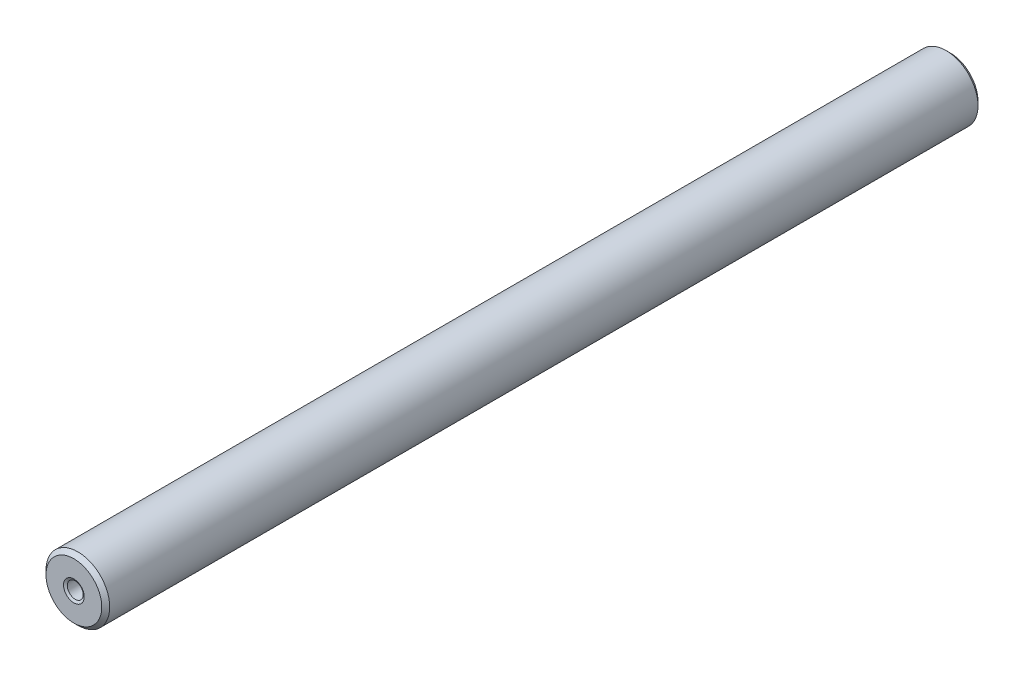
ISO-10303-21;
HEADER;
FILE_DESCRIPTION(('STEP AP214'),'2;1');
FILE_NAME('part.step','',(''),(''),'','','');
FILE_SCHEMA(('AUTOMOTIVE_DESIGN { 1 0 10303 214 1 1 1 1 }'));
ENDSEC;
DATA;
#1=APPLICATION_CONTEXT('core data for automotive mechanical design processes');
#2=APPLICATION_PROTOCOL_DEFINITION('international standard','automotive_design',2000,#1);
#3=PRODUCT_CONTEXT('',#1,'mechanical');
#4=PRODUCT('Part','Part','',(#3));
#5=PRODUCT_RELATED_PRODUCT_CATEGORY('part','',(#4));
#6=PRODUCT_DEFINITION_FORMATION('','',#4);
#7=PRODUCT_DEFINITION_CONTEXT('part definition',#1,'design');
#8=PRODUCT_DEFINITION('design','',#6,#7);
#9=PRODUCT_DEFINITION_SHAPE('','',#8);
#10=(LENGTH_UNIT() NAMED_UNIT(*) SI_UNIT(.MILLI.,.METRE.));
#11=(NAMED_UNIT(*) PLANE_ANGLE_UNIT() SI_UNIT($,.RADIAN.));
#12=(NAMED_UNIT(*) SI_UNIT($,.STERADIAN.) SOLID_ANGLE_UNIT());
#13=UNCERTAINTY_MEASURE_WITH_UNIT(LENGTH_MEASURE(1.E-05),#10,'distance_accuracy_value','');
#14=(GEOMETRIC_REPRESENTATION_CONTEXT(3) GLOBAL_UNCERTAINTY_ASSIGNED_CONTEXT((#13)) GLOBAL_UNIT_ASSIGNED_CONTEXT((#10,
#11,#12)) REPRESENTATION_CONTEXT('',''));
#15=CARTESIAN_POINT('',(0.,0.,0.));
#16=DIRECTION('',(0.,0.,1.));
#17=DIRECTION('',(1.,0.,0.));
#18=AXIS2_PLACEMENT_3D('',#15,#16,#17);
#19=CARTESIAN_POINT('',(0.,0.,108.));
#20=DIRECTION('',(0.,0.,1.));
#21=DIRECTION('',(1.,0.,0.));
#22=AXIS2_PLACEMENT_3D('',#19,#20,#21);
#23=CYLINDRICAL_SURFACE('',#22,1.);
#24=CARTESIAN_POINT('',(0.,0.,1.82679491924313));
#25=DIRECTION('',(0.,0.,1.));
#26=DIRECTION('',(1.,0.,0.));
#27=AXIS2_PLACEMENT_3D('',#24,#25,#26);
#28=CIRCLE('',#27,1.);
#29=CARTESIAN_POINT('',(1.,0.,1.82679491924313));
#30=VERTEX_POINT('',#29);
#31=EDGE_CURVE('E56',#30,#30,#28,.T.);
#32=ORIENTED_EDGE('',*,*,#31,.T.);
#33=EDGE_LOOP('',(#32));
#34=FACE_BOUND('',#33,.T.);
#35=CARTESIAN_POINT('',(0.,0.,0.299999999999995));
#36=DIRECTION('',(0.,0.,1.));
#37=DIRECTION('',(1.,0.,0.));
#38=AXIS2_PLACEMENT_3D('',#35,#36,#37);
#39=CIRCLE('',#38,1.);
#40=CARTESIAN_POINT('',(1.,0.,0.299999999999995));
#41=VERTEX_POINT('',#40);
#42=EDGE_CURVE('E59',#41,#41,#39,.F.);
#43=ORIENTED_EDGE('',*,*,#42,.T.);
#44=EDGE_LOOP('',(#43));
#45=FACE_BOUND('',#44,.T.);
#46=ADVANCED_FACE('F30',(#34,#45),#23,.F.);
#47=CARTESIAN_POINT('',(-1.,0.,0.));
#48=DIRECTION('',(0.,0.,1.));
#49=DIRECTION('',(1.,0.,0.));
#50=AXIS2_PLACEMENT_3D('',#47,#48,#49);
#51=PLANE('',#50);
#52=CARTESIAN_POINT('',(0.,0.,0.));
#53=DIRECTION('',(0.,0.,1.));
#54=DIRECTION('',(1.,0.,0.));
#55=AXIS2_PLACEMENT_3D('',#52,#53,#54);
#56=CIRCLE('',#55,1.17320508075688);
#57=CARTESIAN_POINT('',(1.17320508075688,0.,0.));
#58=VERTEX_POINT('',#57);
#59=EDGE_CURVE('E50',#58,#58,#56,.T.);
#60=ORIENTED_EDGE('',*,*,#59,.T.);
#61=EDGE_LOOP('',(#60));
#62=FACE_BOUND('',#61,.T.);
#63=CARTESIAN_POINT('',(0.,0.,0.));
#64=DIRECTION('',(0.,0.,1.));
#65=DIRECTION('',(1.,0.,0.));
#66=AXIS2_PLACEMENT_3D('',#63,#64,#65);
#67=CIRCLE('',#66,3.50000000000002);
#68=CARTESIAN_POINT('',(3.50000000000002,0.,0.));
#69=VERTEX_POINT('',#68);
#70=EDGE_CURVE('E65',#69,#69,#67,.F.);
#71=ORIENTED_EDGE('',*,*,#70,.T.);
#72=EDGE_LOOP('',(#71));
#73=FACE_BOUND('',#72,.T.);
#74=ADVANCED_FACE('F95',(#62,#73),#51,.F.);
#75=CARTESIAN_POINT('',(0.,0.,108.));
#76=DIRECTION('',(0.,0.,1.));
#77=DIRECTION('',(1.,0.,0.));
#78=AXIS2_PLACEMENT_3D('',#75,#76,#77);
#79=CYLINDRICAL_SURFACE('',#78,4.);
#80=CARTESIAN_POINT('',(0.,0.,0.5));
#81=DIRECTION('',(0.,0.,1.));
#82=DIRECTION('',(1.,0.,0.));
#83=AXIS2_PLACEMENT_3D('',#80,#81,#82);
#84=CIRCLE('',#83,4.);
#85=CARTESIAN_POINT('',(4.,0.,0.5));
#86=VERTEX_POINT('',#85);
#87=EDGE_CURVE('E68',#86,#86,#84,.T.);
#88=ORIENTED_EDGE('',*,*,#87,.T.);
#89=EDGE_LOOP('',(#88));
#90=FACE_BOUND('',#89,.T.);
#91=CARTESIAN_POINT('',(0.,0.,109.5));
#92=DIRECTION('',(0.,0.,-1.));
#93=DIRECTION('',(-1.,0.,0.));
#94=AXIS2_PLACEMENT_3D('',#91,#92,#93);
#95=CIRCLE('',#94,4.);
#96=CARTESIAN_POINT('',(-3.99999999999999,0.,109.5));
#97=VERTEX_POINT('',#96);
#98=EDGE_CURVE('E71',#97,#97,#95,.T.);
#99=ORIENTED_EDGE('',*,*,#98,.T.);
#100=EDGE_LOOP('',(#99));
#101=FACE_BOUND('',#100,.T.);
#102=ADVANCED_FACE('F75',(#90,#101),#79,.T.);
#103=CARTESIAN_POINT('',(-3.99999999999999,0.,110.));
#104=DIRECTION('',(0.,0.,-1.));
#105=DIRECTION('',(-1.,0.,0.));
#106=AXIS2_PLACEMENT_3D('',#103,#104,#105);
#107=PLANE('',#106);
#108=CARTESIAN_POINT('',(0.,0.,110.));
#109=DIRECTION('',(0.,0.,-1.));
#110=DIRECTION('',(-1.,0.,0.));
#111=AXIS2_PLACEMENT_3D('',#108,#109,#110);
#112=CIRCLE('',#111,1.29999999999995);
#113=CARTESIAN_POINT('',(-1.29999999999994,0.,110.));
#114=VERTEX_POINT('',#113);
#115=EDGE_CURVE('E10',#114,#114,#112,.T.);
#116=ORIENTED_EDGE('',*,*,#115,.T.);
#117=EDGE_LOOP('',(#116));
#118=FACE_BOUND('',#117,.T.);
#119=CARTESIAN_POINT('',(0.,0.,110.));
#120=DIRECTION('',(0.,0.,-1.));
#121=DIRECTION('',(-1.,0.,0.));
#122=AXIS2_PLACEMENT_3D('',#119,#120,#121);
#123=CIRCLE('',#122,3.50000000000002);
#124=CARTESIAN_POINT('',(-3.5,0.,110.));
#125=VERTEX_POINT('',#124);
#126=EDGE_CURVE('E62',#125,#125,#123,.F.);
#127=ORIENTED_EDGE('',*,*,#126,.T.);
#128=EDGE_LOOP('',(#127));
#129=FACE_BOUND('',#128,.T.);
#130=ADVANCED_FACE('F85',(#118,#129),#107,.F.);
#131=CARTESIAN_POINT('',(0.,0.,108.));
#132=DIRECTION('',(0.,0.,1.));
#133=DIRECTION('',(1.,0.,0.));
#134=AXIS2_PLACEMENT_3D('',#131,#132,#133);
#135=CYLINDRICAL_SURFACE('',#134,0.999999999999999);
#136=CARTESIAN_POINT('',(0.,0.,108.3));
#137=DIRECTION('',(0.,0.,-1.));
#138=DIRECTION('',(-1.,0.,0.));
#139=AXIS2_PLACEMENT_3D('',#136,#137,#138);
#140=CIRCLE('',#139,0.999999999999999);
#141=CARTESIAN_POINT('',(-0.999999999999987,0.,108.3));
#142=VERTEX_POINT('',#141);
#143=EDGE_CURVE('E37',#142,#142,#140,.T.);
#144=ORIENTED_EDGE('',*,*,#143,.T.);
#145=EDGE_LOOP('',(#144));
#146=FACE_BOUND('',#145,.T.);
#147=CARTESIAN_POINT('',(0.,0.,109.826794919243));
#148=DIRECTION('',(0.,0.,-1.));
#149=DIRECTION('',(-1.,0.,0.));
#150=AXIS2_PLACEMENT_3D('',#147,#148,#149);
#151=CIRCLE('',#150,0.999999999999999);
#152=CARTESIAN_POINT('',(-0.999999999999987,0.,109.826794919243));
#153=VERTEX_POINT('',#152);
#154=EDGE_CURVE('E41',#153,#153,#151,.F.);
#155=ORIENTED_EDGE('',*,*,#154,.T.);
#156=EDGE_LOOP('',(#155));
#157=FACE_BOUND('',#156,.T.);
#158=ADVANCED_FACE('F87',(#146,#157),#135,.F.);
#159=CARTESIAN_POINT('',(0.,0.,108.));
#160=DIRECTION('',(0.,0.,-1.));
#161=DIRECTION('',(-1.,0.,0.));
#162=AXIS2_PLACEMENT_3D('',#159,#160,#161);
#163=PLANE('',#162);
#164=CARTESIAN_POINT('',(0.,0.,108.));
#165=DIRECTION('',(0.,0.,-1.));
#166=DIRECTION('',(-1.,0.,0.));
#167=AXIS2_PLACEMENT_3D('',#164,#165,#166);
#168=CIRCLE('',#167,0.826794919243063);
#169=CARTESIAN_POINT('',(-0.826794919243051,0.,108.));
#170=VERTEX_POINT('',#169);
#171=EDGE_CURVE('E45',#170,#170,#168,.F.);
#172=ORIENTED_EDGE('',*,*,#171,.T.);
#173=EDGE_LOOP('',(#172));
#174=FACE_BOUND('',#173,.T.);
#175=ADVANCED_FACE('F93',(#174),#163,.F.);
#176=CARTESIAN_POINT('',(0.,0.,2.));
#177=DIRECTION('',(0.,0.,1.));
#178=DIRECTION('',(1.,0.,0.));
#179=AXIS2_PLACEMENT_3D('',#176,#177,#178);
#180=PLANE('',#179);
#181=CARTESIAN_POINT('',(0.,0.,2.));
#182=DIRECTION('',(0.,0.,1.));
#183=DIRECTION('',(1.,0.,0.));
#184=AXIS2_PLACEMENT_3D('',#181,#182,#183);
#185=CIRCLE('',#184,0.700000000000023);
#186=CARTESIAN_POINT('',(0.700000000000023,0.,2.));
#187=VERTEX_POINT('',#186);
#188=EDGE_CURVE('E53',#187,#187,#185,.F.);
#189=ORIENTED_EDGE('',*,*,#188,.T.);
#190=EDGE_LOOP('',(#189));
#191=FACE_BOUND('',#190,.T.);
#192=ADVANCED_FACE('F109',(#191),#180,.F.);
#193=CARTESIAN_POINT('',(0.,0.,0.5));
#194=DIRECTION('',(0.,0.,1.));
#195=DIRECTION('',(1.,0.,0.));
#196=AXIS2_PLACEMENT_3D('',#193,#194,#195);
#197=CONICAL_SURFACE('',#196,4.,0.785398163397431);
#198=ORIENTED_EDGE('',*,*,#70,.F.);
#199=EDGE_LOOP('',(#198));
#200=FACE_BOUND('',#199,.T.);
#201=ORIENTED_EDGE('',*,*,#87,.F.);
#202=EDGE_LOOP('',(#201));
#203=FACE_BOUND('',#202,.T.);
#204=ADVANCED_FACE('F81',(#200,#203),#197,.T.);
#205=CARTESIAN_POINT('',(0.,0.,110.));
#206=DIRECTION('',(0.,0.,-1.));
#207=DIRECTION('',(-1.,0.,0.));
#208=AXIS2_PLACEMENT_3D('',#205,#206,#207);
#209=CONICAL_SURFACE('',#208,3.50000000000002,0.785398163397431);
#210=ORIENTED_EDGE('',*,*,#98,.F.);
#211=EDGE_LOOP('',(#210));
#212=FACE_BOUND('',#211,.T.);
#213=ORIENTED_EDGE('',*,*,#126,.F.);
#214=EDGE_LOOP('',(#213));
#215=FACE_BOUND('',#214,.T.);
#216=ADVANCED_FACE('F77',(#212,#215),#209,.T.);
#217=CARTESIAN_POINT('',(0.,0.,1.82679491924313));
#218=DIRECTION('',(0.,0.,-1.));
#219=DIRECTION('',(-1.,0.,0.));
#220=AXIS2_PLACEMENT_3D('',#217,#218,#219);
#221=CONICAL_SURFACE('',#220,1.,1.04719755119662);
#222=ORIENTED_EDGE('',*,*,#188,.F.);
#223=EDGE_LOOP('',(#222));
#224=FACE_BOUND('',#223,.T.);
#225=ORIENTED_EDGE('',*,*,#31,.F.);
#226=EDGE_LOOP('',(#225));
#227=FACE_BOUND('',#226,.T.);
#228=ADVANCED_FACE('F80',(#224,#227),#221,.F.);
#229=CARTESIAN_POINT('',(0.,0.,0.));
#230=DIRECTION('',(0.,0.,-1.));
#231=DIRECTION('',(-1.,0.,0.));
#232=AXIS2_PLACEMENT_3D('',#229,#230,#231);
#233=CONICAL_SURFACE('',#232,1.17320508075688,0.523598775598279);
#234=ORIENTED_EDGE('',*,*,#42,.F.);
#235=EDGE_LOOP('',(#234));
#236=FACE_BOUND('',#235,.T.);
#237=ORIENTED_EDGE('',*,*,#59,.F.);
#238=EDGE_LOOP('',(#237));
#239=FACE_BOUND('',#238,.T.);
#240=ADVANCED_FACE('F114',(#236,#239),#233,.F.);
#241=CARTESIAN_POINT('',(0.,0.,108.));
#242=DIRECTION('',(0.,0.,1.));
#243=DIRECTION('',(1.,0.,0.));
#244=AXIS2_PLACEMENT_3D('',#241,#242,#243);
#245=CONICAL_SURFACE('',#244,0.826794919243063,0.523598775598307);
#246=ORIENTED_EDGE('',*,*,#143,.F.);
#247=EDGE_LOOP('',(#246));
#248=FACE_BOUND('',#247,.T.);
#249=ORIENTED_EDGE('',*,*,#171,.F.);
#250=EDGE_LOOP('',(#249));
#251=FACE_BOUND('',#250,.T.);
#252=ADVANCED_FACE('F117',(#248,#251),#245,.F.);
#253=CARTESIAN_POINT('',(0.,0.,109.826794919243));
#254=DIRECTION('',(0.,0.,1.));
#255=DIRECTION('',(1.,0.,0.));
#256=AXIS2_PLACEMENT_3D('',#253,#254,#255);
#257=CONICAL_SURFACE('',#256,0.999999999999999,1.04719755119661);
#258=ORIENTED_EDGE('',*,*,#115,.F.);
#259=EDGE_LOOP('',(#258));
#260=FACE_BOUND('',#259,.T.);
#261=ORIENTED_EDGE('',*,*,#154,.F.);
#262=EDGE_LOOP('',(#261));
#263=FACE_BOUND('',#262,.T.);
#264=ADVANCED_FACE('F32',(#260,#263),#257,.F.);
#265=CLOSED_SHELL('',(#46,#74,#102,#130,#158,#175,#192,#204,#216,#228,#240,#252,#264));
#266=MANIFOLD_SOLID_BREP('B2',#265);
#267=ADVANCED_BREP_SHAPE_REPRESENTATION('',(#18,#266),#14);
#268=SHAPE_DEFINITION_REPRESENTATION(#9,#267);
ENDSEC;
END-ISO-10303-21;
